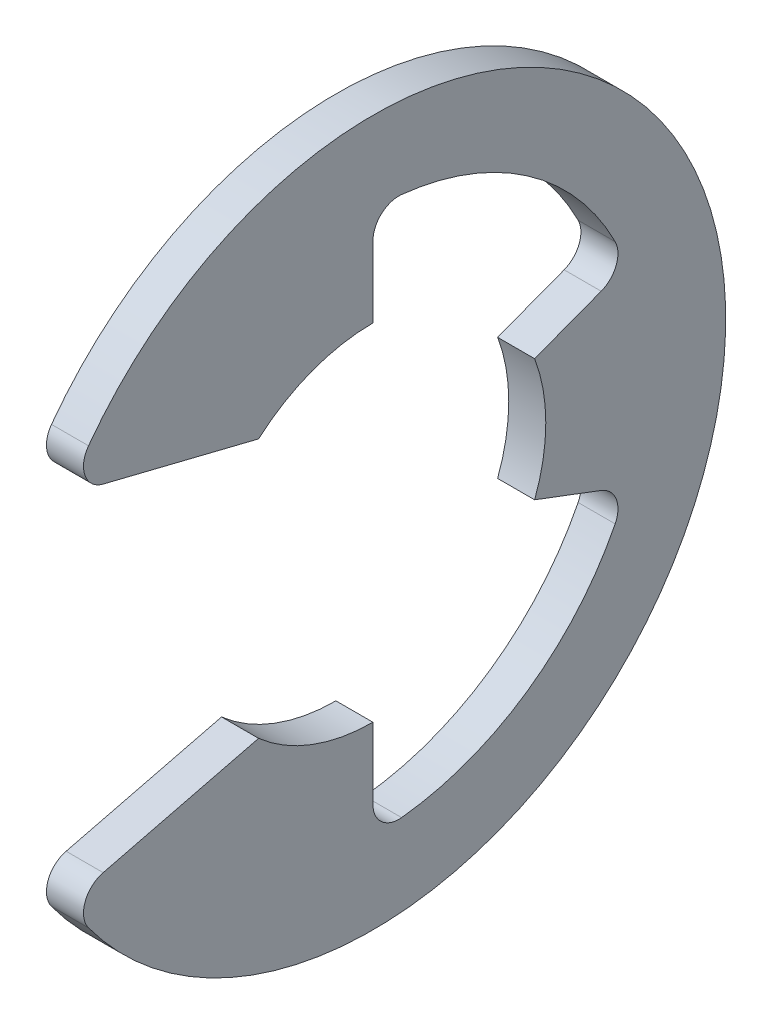
ISO-10303-21;
HEADER;
FILE_DESCRIPTION(('STEP AP214'),'2;1');
FILE_NAME('part.step','',(''),(''),'','','');
FILE_SCHEMA(('AUTOMOTIVE_DESIGN { 1 0 10303 214 1 1 1 1 }'));
ENDSEC;
DATA;
#1=APPLICATION_CONTEXT('core data for automotive mechanical design processes');
#2=APPLICATION_PROTOCOL_DEFINITION('international standard','automotive_design',2000,#1);
#3=PRODUCT_CONTEXT('',#1,'mechanical');
#4=PRODUCT('Part','Part','',(#3));
#5=PRODUCT_RELATED_PRODUCT_CATEGORY('part','',(#4));
#6=PRODUCT_DEFINITION_FORMATION('','',#4);
#7=PRODUCT_DEFINITION_CONTEXT('part definition',#1,'design');
#8=PRODUCT_DEFINITION('design','',#6,#7);
#9=PRODUCT_DEFINITION_SHAPE('','',#8);
#10=(LENGTH_UNIT() NAMED_UNIT(*) SI_UNIT(.MILLI.,.METRE.));
#11=(NAMED_UNIT(*) PLANE_ANGLE_UNIT() SI_UNIT($,.RADIAN.));
#12=(NAMED_UNIT(*) SI_UNIT($,.STERADIAN.) SOLID_ANGLE_UNIT());
#13=UNCERTAINTY_MEASURE_WITH_UNIT(LENGTH_MEASURE(1.E-05),#10,'distance_accuracy_value','');
#14=(GEOMETRIC_REPRESENTATION_CONTEXT(3) GLOBAL_UNCERTAINTY_ASSIGNED_CONTEXT((#13)) GLOBAL_UNIT_ASSIGNED_CONTEXT((#10,
#11,#12)) REPRESENTATION_CONTEXT('',''));
#15=CARTESIAN_POINT('',(0.,0.,0.));
#16=DIRECTION('',(0.,0.,1.));
#17=DIRECTION('',(1.,0.,0.));
#18=AXIS2_PLACEMENT_3D('',#15,#16,#17);
#19=CARTESIAN_POINT('',(0.5334,0.,0.));
#20=DIRECTION('',(1.,0.,0.));
#21=DIRECTION('',(0.,0.,-1.));
#22=AXIS2_PLACEMENT_3D('',#19,#20,#21);
#23=PLANE('',#22);
#24=DIRECTION('',(0.,-1.,0.));
#25=VECTOR('',#24,1.);
#26=CARTESIAN_POINT('',(0.5334,-4.9784,0.));
#27=LINE('',#26,#25);
#28=CARTESIAN_POINT('',(0.5334,-7.02704023617216,0.));
#29=VERTEX_POINT('',#28);
#30=CARTESIAN_POINT('',(0.5334,-4.9784,0.));
#31=VERTEX_POINT('',#30);
#32=EDGE_CURVE('E168',#29,#31,#27,.F.);
#33=ORIENTED_EDGE('',*,*,#32,.T.);
#34=CARTESIAN_POINT('',(0.5334,0.,0.));
#35=DIRECTION('',(-1.,0.,0.));
#36=DIRECTION('',(0.,0.,1.));
#37=AXIS2_PLACEMENT_3D('',#34,#35,#36);
#38=CIRCLE('',#37,4.9784);
#39=CARTESIAN_POINT('',(0.5334,-3.7338,3.29290208175099));
#40=VERTEX_POINT('',#39);
#41=EDGE_CURVE('E224',#31,#40,#38,.T.);
#42=ORIENTED_EDGE('',*,*,#41,.T.);
#43=DIRECTION('',(0.,0.240952820606873,-0.970536829925373));
#44=VECTOR('',#43,1.);
#45=CARTESIAN_POINT('',(0.5334,-5.09813480407811,8.78832302088672));
#46=LINE('',#45,#44);
#47=CARTESIAN_POINT('',(0.5334,-4.84496174240152,7.76856413164343));
#48=VERTEX_POINT('',#47);
#49=EDGE_CURVE('E163',#40,#48,#46,.F.);
#50=ORIENTED_EDGE('',*,*,#49,.T.);
#51=CARTESIAN_POINT('',(0.5334,-5.56971982551659,7.58863020332705));
#52=DIRECTION('',(-1.,0.,0.));
#53=DIRECTION('',(0.,0.,1.));
#54=AXIS2_PLACEMENT_3D('',#51,#52,#53);
#55=CIRCLE('',#54,0.746760000000001);
#56=CARTESIAN_POINT('',(0.5334,-6.01157023801035,8.19064242129201));
#57=VERTEX_POINT('',#56);
#58=EDGE_CURVE('E222',#57,#48,#55,.T.);
#59=ORIENTED_EDGE('',*,*,#58,.F.);
#60=CARTESIAN_POINT('',(0.5334,0.,0.));
#61=DIRECTION('',(-1.,0.,0.));
#62=DIRECTION('',(0.,0.,1.));
#63=AXIS2_PLACEMENT_3D('',#60,#61,#62);
#64=CIRCLE('',#63,10.16);
#65=CARTESIAN_POINT('',(0.5334,6.01157023801035,8.19064242129201));
#66=VERTEX_POINT('',#65);
#67=EDGE_CURVE('E143',#66,#57,#64,.T.);
#68=ORIENTED_EDGE('',*,*,#67,.F.);
#69=CARTESIAN_POINT('',(0.5334,5.56971982551659,7.58863020332705));
#70=DIRECTION('',(-1.,0.,0.));
#71=DIRECTION('',(0.,0.,1.));
#72=AXIS2_PLACEMENT_3D('',#69,#70,#71);
#73=CIRCLE('',#72,0.74676);
#74=CARTESIAN_POINT('',(0.5334,4.84496174240152,7.76856413164343));
#75=VERTEX_POINT('',#74);
#76=EDGE_CURVE('E21',#75,#66,#73,.T.);
#77=ORIENTED_EDGE('',*,*,#76,.F.);
#78=DIRECTION('',(0.,0.240952820606873,0.970536829925373));
#79=VECTOR('',#78,1.);
#80=CARTESIAN_POINT('',(0.5334,5.09813480407811,8.78832302088672));
#81=LINE('',#80,#79);
#82=CARTESIAN_POINT('',(0.5334,3.7338,3.29290208175099));
#83=VERTEX_POINT('',#82);
#84=EDGE_CURVE('E140',#75,#83,#81,.F.);
#85=ORIENTED_EDGE('',*,*,#84,.T.);
#86=CARTESIAN_POINT('',(0.5334,0.,0.));
#87=DIRECTION('',(-1.,0.,0.));
#88=DIRECTION('',(0.,0.,1.));
#89=AXIS2_PLACEMENT_3D('',#86,#87,#88);
#90=CIRCLE('',#89,4.9784);
#91=CARTESIAN_POINT('',(0.5334,4.9784,0.));
#92=VERTEX_POINT('',#91);
#93=EDGE_CURVE('E243',#83,#92,#90,.T.);
#94=ORIENTED_EDGE('',*,*,#93,.T.);
#95=DIRECTION('',(0.,-1.,0.));
#96=VECTOR('',#95,1.);
#97=CARTESIAN_POINT('',(0.5334,4.9784,0.));
#98=LINE('',#97,#96);
#99=CARTESIAN_POINT('',(0.5334,7.02704023617216,0.));
#100=VERTEX_POINT('',#99);
#101=EDGE_CURVE('E180',#92,#100,#98,.F.);
#102=ORIENTED_EDGE('',*,*,#101,.T.);
#103=CARTESIAN_POINT('',(0.5334,7.02704023617216,-0.746759999999999));
#104=DIRECTION('',(-1.,0.,0.));
#105=DIRECTION('',(0.,0.,1.));
#106=AXIS2_PLACEMENT_3D('',#103,#104,#105);
#107=CIRCLE('',#106,0.74676);
#108=CARTESIAN_POINT('',(0.5334,7.76961896112721,-0.825673464276603));
#109=VERTEX_POINT('',#108);
#110=EDGE_CURVE('E242',#100,#109,#107,.T.);
#111=ORIENTED_EDGE('',*,*,#110,.T.);
#112=CARTESIAN_POINT('',(0.5334,0.,0.));
#113=DIRECTION('',(-1.,0.,0.));
#114=DIRECTION('',(0.,0.,1.));
#115=AXIS2_PLACEMENT_3D('',#112,#113,#114);
#116=CIRCLE('',#115,7.81336774193548);
#117=CARTESIAN_POINT('',(0.5334,3.51932193149276,-6.97589339176224));
#118=VERTEX_POINT('',#117);
#119=EDGE_CURVE('E239',#109,#118,#116,.T.);
#120=ORIENTED_EDGE('',*,*,#119,.T.);
#121=CARTESIAN_POINT('',(0.5334,3.18296391887085,-6.30917472174839));
#122=DIRECTION('',(-1.,0.,0.));
#123=DIRECTION('',(0.,0.,1.));
#124=AXIS2_PLACEMENT_3D('',#121,#122,#123);
#125=CIRCLE('',#124,0.74676);
#126=CARTESIAN_POINT('',(0.5334,2.48443390133403,-6.57319425170782));
#127=VERTEX_POINT('',#126);
#128=EDGE_CURVE('E236',#118,#127,#125,.T.);
#129=ORIENTED_EDGE('',*,*,#128,.T.);
#130=DIRECTION('',(0.,0.353553390593274,-0.935414346693485));
#131=VECTOR('',#130,1.);
#132=CARTESIAN_POINT('',(0.5334,1.76013019972955,-4.65686678357885));
#133=LINE('',#132,#131);
#134=CARTESIAN_POINT('',(0.5334,1.76013019972955,-4.65686678357885));
#135=VERTEX_POINT('',#134);
#136=EDGE_CURVE('E176',#127,#135,#133,.F.);
#137=ORIENTED_EDGE('',*,*,#136,.T.);
#138=CARTESIAN_POINT('',(0.5334,0.,0.));
#139=DIRECTION('',(-1.,0.,0.));
#140=DIRECTION('',(0.,0.,1.));
#141=AXIS2_PLACEMENT_3D('',#138,#139,#140);
#142=CIRCLE('',#141,4.9784);
#143=CARTESIAN_POINT('',(0.5334,-1.76013019972955,-4.65686678357885));
#144=VERTEX_POINT('',#143);
#145=EDGE_CURVE('E234',#135,#144,#142,.T.);
#146=ORIENTED_EDGE('',*,*,#145,.T.);
#147=DIRECTION('',(0.,0.353553390593274,0.935414346693485));
#148=VECTOR('',#147,1.);
#149=CARTESIAN_POINT('',(0.5334,-1.76013019972955,-4.65686678357885));
#150=LINE('',#149,#148);
#151=CARTESIAN_POINT('',(0.5334,-2.48443390133403,-6.57319425170782));
#152=VERTEX_POINT('',#151);
#153=EDGE_CURVE('E172',#144,#152,#150,.F.);
#154=ORIENTED_EDGE('',*,*,#153,.T.);
#155=CARTESIAN_POINT('',(0.5334,-3.18296391887085,-6.30917472174839));
#156=DIRECTION('',(-1.,0.,0.));
#157=DIRECTION('',(0.,0.,1.));
#158=AXIS2_PLACEMENT_3D('',#155,#156,#157);
#159=CIRCLE('',#158,0.74676);
#160=CARTESIAN_POINT('',(0.5334,-3.51932193149276,-6.97589339176224));
#161=VERTEX_POINT('',#160);
#162=EDGE_CURVE('E232',#152,#161,#159,.T.);
#163=ORIENTED_EDGE('',*,*,#162,.T.);
#164=CARTESIAN_POINT('',(0.5334,0.,0.));
#165=DIRECTION('',(-1.,0.,0.));
#166=DIRECTION('',(0.,0.,1.));
#167=AXIS2_PLACEMENT_3D('',#164,#165,#166);
#168=CIRCLE('',#167,7.81336774193548);
#169=CARTESIAN_POINT('',(0.5334,-7.76961896112721,-0.825673464276605));
#170=VERTEX_POINT('',#169);
#171=EDGE_CURVE('E229',#161,#170,#168,.T.);
#172=ORIENTED_EDGE('',*,*,#171,.T.);
#173=CARTESIAN_POINT('',(0.5334,-7.02704023617216,-0.74676));
#174=DIRECTION('',(-1.,0.,0.));
#175=DIRECTION('',(0.,0.,1.));
#176=AXIS2_PLACEMENT_3D('',#173,#174,#175);
#177=CIRCLE('',#176,0.74676);
#178=EDGE_CURVE('E226',#170,#29,#177,.T.);
#179=ORIENTED_EDGE('',*,*,#178,.T.);
#180=EDGE_LOOP('',(#33,#42,#50,#59,#68,#77,#85,#94,#102,#111,#120,#129,#137,#146,#154,#163,#172,#179));
#181=FACE_BOUND('',#180,.T.);
#182=ADVANCED_FACE('F18',(#181),#23,.T.);
#183=CARTESIAN_POINT('',(0.5334,5.56971982551659,7.58863020332705));
#184=DIRECTION('',(-1.,0.,0.));
#185=DIRECTION('',(0.,0.,1.));
#186=AXIS2_PLACEMENT_3D('',#183,#184,#185);
#187=CYLINDRICAL_SURFACE('',#186,0.74676);
#188=CARTESIAN_POINT('',(-0.5334,5.56971982551659,7.58863020332705));
#189=DIRECTION('',(-1.,0.,0.));
#190=DIRECTION('',(0.,0.,1.));
#191=AXIS2_PLACEMENT_3D('',#188,#189,#190);
#192=CIRCLE('',#191,0.74676);
#193=CARTESIAN_POINT('',(-0.5334,6.01157023801035,8.19064242129201));
#194=VERTEX_POINT('',#193);
#195=CARTESIAN_POINT('',(-0.5334,4.84496174240152,7.76856413164343));
#196=VERTEX_POINT('',#195);
#197=EDGE_CURVE('E158',#194,#196,#192,.F.);
#198=ORIENTED_EDGE('',*,*,#197,.T.);
#199=DIRECTION('',(1.,0.,0.));
#200=VECTOR('',#199,1.);
#201=CARTESIAN_POINT('',(0.5334,4.84496174240152,7.76856413164343));
#202=LINE('',#201,#200);
#203=EDGE_CURVE('E148',#196,#75,#202,.T.);
#204=ORIENTED_EDGE('',*,*,#203,.T.);
#205=ORIENTED_EDGE('',*,*,#76,.T.);
#206=DIRECTION('',(-1.,0.,0.));
#207=VECTOR('',#206,1.);
#208=CARTESIAN_POINT('',(0.5334,6.01157023801035,8.19064242129201));
#209=LINE('',#208,#207);
#210=EDGE_CURVE('E219',#194,#66,#209,.F.);
#211=ORIENTED_EDGE('',*,*,#210,.F.);
#212=EDGE_LOOP('',(#198,#204,#205,#211));
#213=FACE_BOUND('',#212,.T.);
#214=ADVANCED_FACE('F157',(#213),#187,.T.);
#215=CARTESIAN_POINT('',(0.5334,5.09813480407811,8.78832302088672));
#216=DIRECTION('',(0.,0.970536829925373,-0.240952820606873));
#217=DIRECTION('',(0.,0.240952820606873,0.970536829925373));
#218=AXIS2_PLACEMENT_3D('',#215,#216,#217);
#219=PLANE('',#218);
#220=ORIENTED_EDGE('',*,*,#203,.F.);
#221=DIRECTION('',(0.,-0.240952820606873,-0.970536829925373));
#222=VECTOR('',#221,1.);
#223=CARTESIAN_POINT('',(-0.5334,4.84496174240152,7.76856413164343));
#224=LINE('',#223,#222);
#225=CARTESIAN_POINT('',(-0.5334,3.7338,3.29290208175099));
#226=VERTEX_POINT('',#225);
#227=EDGE_CURVE('E217',#196,#226,#224,.T.);
#228=ORIENTED_EDGE('',*,*,#227,.T.);
#229=DIRECTION('',(-1.,0.,0.));
#230=VECTOR('',#229,1.);
#231=CARTESIAN_POINT('',(0.5334,3.7338,3.29290208175099));
#232=LINE('',#231,#230);
#233=EDGE_CURVE('E155',#226,#83,#232,.F.);
#234=ORIENTED_EDGE('',*,*,#233,.T.);
#235=ORIENTED_EDGE('',*,*,#84,.F.);
#236=EDGE_LOOP('',(#220,#228,#234,#235));
#237=FACE_BOUND('',#236,.T.);
#238=ADVANCED_FACE('F152',(#237),#219,.F.);
#239=CARTESIAN_POINT('',(0.5334,0.,0.));
#240=DIRECTION('',(-1.,0.,0.));
#241=DIRECTION('',(0.,0.,1.));
#242=AXIS2_PLACEMENT_3D('',#239,#240,#241);
#243=CYLINDRICAL_SURFACE('',#242,4.9784);
#244=DIRECTION('',(1.,0.,0.));
#245=VECTOR('',#244,1.);
#246=CARTESIAN_POINT('',(0.5334,4.9784,0.));
#247=LINE('',#246,#245);
#248=CARTESIAN_POINT('',(-0.5334,4.9784,0.));
#249=VERTEX_POINT('',#248);
#250=EDGE_CURVE('E182',#249,#92,#247,.T.);
#251=ORIENTED_EDGE('',*,*,#250,.T.);
#252=ORIENTED_EDGE('',*,*,#93,.F.);
#253=ORIENTED_EDGE('',*,*,#233,.F.);
#254=CARTESIAN_POINT('',(-0.5334,0.,0.));
#255=DIRECTION('',(-1.,0.,0.));
#256=DIRECTION('',(0.,0.,1.));
#257=AXIS2_PLACEMENT_3D('',#254,#255,#256);
#258=CIRCLE('',#257,4.9784);
#259=EDGE_CURVE('E214',#226,#249,#258,.T.);
#260=ORIENTED_EDGE('',*,*,#259,.T.);
#261=EDGE_LOOP('',(#251,#252,#253,#260));
#262=FACE_BOUND('',#261,.T.);
#263=ADVANCED_FACE('F341',(#262),#243,.F.);
#264=CARTESIAN_POINT('',(0.5334,4.9784,0.));
#265=DIRECTION('',(0.,0.,1.));
#266=DIRECTION('',(0.,-1.,0.));
#267=AXIS2_PLACEMENT_3D('',#264,#265,#266);
#268=PLANE('',#267);
#269=DIRECTION('',(-1.,0.,0.));
#270=VECTOR('',#269,1.);
#271=CARTESIAN_POINT('',(0.5334,7.02704023617216,0.));
#272=LINE('',#271,#270);
#273=CARTESIAN_POINT('',(-0.5334,7.02704023617216,0.));
#274=VERTEX_POINT('',#273);
#275=EDGE_CURVE('E181',#274,#100,#272,.F.);
#276=ORIENTED_EDGE('',*,*,#275,.T.);
#277=ORIENTED_EDGE('',*,*,#101,.F.);
#278=ORIENTED_EDGE('',*,*,#250,.F.);
#279=DIRECTION('',(0.,1.,0.));
#280=VECTOR('',#279,1.);
#281=CARTESIAN_POINT('',(-0.5334,0.,0.));
#282=LINE('',#281,#280);
#283=EDGE_CURVE('E213',#249,#274,#282,.T.);
#284=ORIENTED_EDGE('',*,*,#283,.T.);
#285=EDGE_LOOP('',(#276,#277,#278,#284));
#286=FACE_BOUND('',#285,.T.);
#287=ADVANCED_FACE('F339',(#286),#268,.F.);
#288=CARTESIAN_POINT('',(0.5334,7.02704023617216,-0.746759999999999));
#289=DIRECTION('',(-1.,0.,0.));
#290=DIRECTION('',(0.,0.,1.));
#291=AXIS2_PLACEMENT_3D('',#288,#289,#290);
#292=CYLINDRICAL_SURFACE('',#291,0.74676);
#293=ORIENTED_EDGE('',*,*,#275,.F.);
#294=CARTESIAN_POINT('',(-0.5334,7.02704023617216,-0.746759999999999));
#295=DIRECTION('',(-1.,0.,0.));
#296=DIRECTION('',(0.,0.,1.));
#297=AXIS2_PLACEMENT_3D('',#294,#295,#296);
#298=CIRCLE('',#297,0.74676);
#299=CARTESIAN_POINT('',(-0.5334,7.76961896112721,-0.825673464276603));
#300=VERTEX_POINT('',#299);
#301=EDGE_CURVE('E210',#274,#300,#298,.T.);
#302=ORIENTED_EDGE('',*,*,#301,.T.);
#303=DIRECTION('',(-1.,0.,0.));
#304=VECTOR('',#303,1.);
#305=CARTESIAN_POINT('',(0.5334,7.76961896112721,-0.825673464276603));
#306=LINE('',#305,#304);
#307=EDGE_CURVE('E241',#300,#109,#306,.F.);
#308=ORIENTED_EDGE('',*,*,#307,.T.);
#309=ORIENTED_EDGE('',*,*,#110,.F.);
#310=EDGE_LOOP('',(#293,#302,#308,#309));
#311=FACE_BOUND('',#310,.T.);
#312=ADVANCED_FACE('F336',(#311),#292,.F.);
#313=CARTESIAN_POINT('',(0.5334,0.,0.));
#314=DIRECTION('',(-1.,0.,0.));
#315=DIRECTION('',(0.,0.,1.));
#316=AXIS2_PLACEMENT_3D('',#313,#314,#315);
#317=CYLINDRICAL_SURFACE('',#316,7.81336774193548);
#318=ORIENTED_EDGE('',*,*,#307,.F.);
#319=CARTESIAN_POINT('',(-0.5334,0.,0.));
#320=DIRECTION('',(-1.,0.,0.));
#321=DIRECTION('',(0.,0.,1.));
#322=AXIS2_PLACEMENT_3D('',#319,#320,#321);
#323=CIRCLE('',#322,7.81336774193548);
#324=CARTESIAN_POINT('',(-0.5334,3.51932193149276,-6.97589339176224));
#325=VERTEX_POINT('',#324);
#326=EDGE_CURVE('E207',#300,#325,#323,.T.);
#327=ORIENTED_EDGE('',*,*,#326,.T.);
#328=DIRECTION('',(-1.,0.,0.));
#329=VECTOR('',#328,1.);
#330=CARTESIAN_POINT('',(0.5334,3.51932193149276,-6.97589339176224));
#331=LINE('',#330,#329);
#332=EDGE_CURVE('E238',#325,#118,#331,.F.);
#333=ORIENTED_EDGE('',*,*,#332,.T.);
#334=ORIENTED_EDGE('',*,*,#119,.F.);
#335=EDGE_LOOP('',(#318,#327,#333,#334));
#336=FACE_BOUND('',#335,.T.);
#337=ADVANCED_FACE('F332',(#336),#317,.F.);
#338=CARTESIAN_POINT('',(0.5334,3.18296391887085,-6.30917472174839));
#339=DIRECTION('',(-1.,0.,0.));
#340=DIRECTION('',(0.,0.,1.));
#341=AXIS2_PLACEMENT_3D('',#338,#339,#340);
#342=CYLINDRICAL_SURFACE('',#341,0.74676);
#343=ORIENTED_EDGE('',*,*,#332,.F.);
#344=CARTESIAN_POINT('',(-0.5334,3.18296391887085,-6.30917472174839));
#345=DIRECTION('',(-1.,0.,0.));
#346=DIRECTION('',(0.,0.,1.));
#347=AXIS2_PLACEMENT_3D('',#344,#345,#346);
#348=CIRCLE('',#347,0.74676);
#349=CARTESIAN_POINT('',(-0.5334,2.48443390133403,-6.57319425170782));
#350=VERTEX_POINT('',#349);
#351=EDGE_CURVE('E204',#325,#350,#348,.T.);
#352=ORIENTED_EDGE('',*,*,#351,.T.);
#353=DIRECTION('',(1.,0.,0.));
#354=VECTOR('',#353,1.);
#355=CARTESIAN_POINT('',(0.5334,2.48443390133403,-6.57319425170782));
#356=LINE('',#355,#354);
#357=EDGE_CURVE('E179',#350,#127,#356,.T.);
#358=ORIENTED_EDGE('',*,*,#357,.T.);
#359=ORIENTED_EDGE('',*,*,#128,.F.);
#360=EDGE_LOOP('',(#343,#352,#358,#359));
#361=FACE_BOUND('',#360,.T.);
#362=ADVANCED_FACE('F328',(#361),#342,.F.);
#363=CARTESIAN_POINT('',(0.5334,1.76013019972955,-4.65686678357885));
#364=DIRECTION('',(0.,-0.935414346693485,-0.353553390593274));
#365=DIRECTION('',(0.,0.353553390593274,-0.935414346693485));
#366=AXIS2_PLACEMENT_3D('',#363,#364,#365);
#367=PLANE('',#366);
#368=ORIENTED_EDGE('',*,*,#357,.F.);
#369=DIRECTION('',(0.,-0.353553390593275,0.935414346693485));
#370=VECTOR('',#369,1.);
#371=CARTESIAN_POINT('',(-0.5334,2.48443390133403,-6.57319425170782));
#372=LINE('',#371,#370);
#373=CARTESIAN_POINT('',(-0.5334,1.76013019972955,-4.65686678357885));
#374=VERTEX_POINT('',#373);
#375=EDGE_CURVE('E203',#350,#374,#372,.T.);
#376=ORIENTED_EDGE('',*,*,#375,.T.);
#377=DIRECTION('',(-1.,0.,0.));
#378=VECTOR('',#377,1.);
#379=CARTESIAN_POINT('',(0.5334,1.76013019972955,-4.65686678357885));
#380=LINE('',#379,#378);
#381=EDGE_CURVE('E178',#374,#135,#380,.F.);
#382=ORIENTED_EDGE('',*,*,#381,.T.);
#383=ORIENTED_EDGE('',*,*,#136,.F.);
#384=EDGE_LOOP('',(#368,#376,#382,#383));
#385=FACE_BOUND('',#384,.T.);
#386=ADVANCED_FACE('F324',(#385),#367,.F.);
#387=CARTESIAN_POINT('',(0.5334,0.,0.));
#388=DIRECTION('',(-1.,0.,0.));
#389=DIRECTION('',(0.,0.,1.));
#390=AXIS2_PLACEMENT_3D('',#387,#388,#389);
#391=CYLINDRICAL_SURFACE('',#390,4.9784);
#392=DIRECTION('',(1.,0.,0.));
#393=VECTOR('',#392,1.);
#394=CARTESIAN_POINT('',(0.5334,-1.76013019972955,-4.65686678357885));
#395=LINE('',#394,#393);
#396=CARTESIAN_POINT('',(-0.5334,-1.76013019972955,-4.65686678357885));
#397=VERTEX_POINT('',#396);
#398=EDGE_CURVE('E175',#397,#144,#395,.T.);
#399=ORIENTED_EDGE('',*,*,#398,.T.);
#400=ORIENTED_EDGE('',*,*,#145,.F.);
#401=ORIENTED_EDGE('',*,*,#381,.F.);
#402=CARTESIAN_POINT('',(-0.5334,0.,0.));
#403=DIRECTION('',(-1.,0.,0.));
#404=DIRECTION('',(0.,0.,1.));
#405=AXIS2_PLACEMENT_3D('',#402,#403,#404);
#406=CIRCLE('',#405,4.9784);
#407=EDGE_CURVE('E200',#374,#397,#406,.T.);
#408=ORIENTED_EDGE('',*,*,#407,.T.);
#409=EDGE_LOOP('',(#399,#400,#401,#408));
#410=FACE_BOUND('',#409,.T.);
#411=ADVANCED_FACE('F320',(#410),#391,.F.);
#412=CARTESIAN_POINT('',(0.5334,-1.76013019972955,-4.65686678357885));
#413=DIRECTION('',(0.,0.935414346693485,-0.353553390593274));
#414=DIRECTION('',(0.,0.353553390593274,0.935414346693485));
#415=AXIS2_PLACEMENT_3D('',#412,#413,#414);
#416=PLANE('',#415);
#417=DIRECTION('',(-1.,0.,0.));
#418=VECTOR('',#417,1.);
#419=CARTESIAN_POINT('',(0.5334,-2.48443390133403,-6.57319425170782));
#420=LINE('',#419,#418);
#421=CARTESIAN_POINT('',(-0.5334,-2.48443390133403,-6.57319425170782));
#422=VERTEX_POINT('',#421);
#423=EDGE_CURVE('E174',#422,#152,#420,.F.);
#424=ORIENTED_EDGE('',*,*,#423,.T.);
#425=ORIENTED_EDGE('',*,*,#153,.F.);
#426=ORIENTED_EDGE('',*,*,#398,.F.);
#427=DIRECTION('',(0.,-0.353553390593274,-0.935414346693485));
#428=VECTOR('',#427,1.);
#429=CARTESIAN_POINT('',(-0.5334,-1.76013019972955,-4.65686678357885));
#430=LINE('',#429,#428);
#431=EDGE_CURVE('E199',#397,#422,#430,.T.);
#432=ORIENTED_EDGE('',*,*,#431,.T.);
#433=EDGE_LOOP('',(#424,#425,#426,#432));
#434=FACE_BOUND('',#433,.T.);
#435=ADVANCED_FACE('F316',(#434),#416,.F.);
#436=CARTESIAN_POINT('',(0.5334,-3.18296391887085,-6.30917472174839));
#437=DIRECTION('',(-1.,0.,0.));
#438=DIRECTION('',(0.,0.,1.));
#439=AXIS2_PLACEMENT_3D('',#436,#437,#438);
#440=CYLINDRICAL_SURFACE('',#439,0.74676);
#441=ORIENTED_EDGE('',*,*,#423,.F.);
#442=CARTESIAN_POINT('',(-0.5334,-3.18296391887085,-6.30917472174839));
#443=DIRECTION('',(-1.,0.,0.));
#444=DIRECTION('',(0.,0.,1.));
#445=AXIS2_PLACEMENT_3D('',#442,#443,#444);
#446=CIRCLE('',#445,0.74676);
#447=CARTESIAN_POINT('',(-0.5334,-3.51932193149276,-6.97589339176224));
#448=VERTEX_POINT('',#447);
#449=EDGE_CURVE('E196',#422,#448,#446,.T.);
#450=ORIENTED_EDGE('',*,*,#449,.T.);
#451=DIRECTION('',(-1.,0.,0.));
#452=VECTOR('',#451,1.);
#453=CARTESIAN_POINT('',(0.5334,-3.51932193149276,-6.97589339176224));
#454=LINE('',#453,#452);
#455=EDGE_CURVE('E231',#448,#161,#454,.F.);
#456=ORIENTED_EDGE('',*,*,#455,.T.);
#457=ORIENTED_EDGE('',*,*,#162,.F.);
#458=EDGE_LOOP('',(#441,#450,#456,#457));
#459=FACE_BOUND('',#458,.T.);
#460=ADVANCED_FACE('F312',(#459),#440,.F.);
#461=CARTESIAN_POINT('',(0.5334,0.,0.));
#462=DIRECTION('',(-1.,0.,0.));
#463=DIRECTION('',(0.,0.,1.));
#464=AXIS2_PLACEMENT_3D('',#461,#462,#463);
#465=CYLINDRICAL_SURFACE('',#464,7.81336774193548);
#466=DIRECTION('',(-1.,0.,0.));
#467=VECTOR('',#466,1.);
#468=CARTESIAN_POINT('',(0.5334,-7.76961896112721,-0.825673464276605));
#469=LINE('',#468,#467);
#470=CARTESIAN_POINT('',(-0.5334,-7.76961896112721,-0.825673464276605));
#471=VERTEX_POINT('',#470);
#472=EDGE_CURVE('E228',#471,#170,#469,.F.);
#473=ORIENTED_EDGE('',*,*,#472,.T.);
#474=ORIENTED_EDGE('',*,*,#171,.F.);
#475=ORIENTED_EDGE('',*,*,#455,.F.);
#476=CARTESIAN_POINT('',(-0.5334,0.,0.));
#477=DIRECTION('',(-1.,0.,0.));
#478=DIRECTION('',(0.,0.,1.));
#479=AXIS2_PLACEMENT_3D('',#476,#477,#478);
#480=CIRCLE('',#479,7.81336774193548);
#481=EDGE_CURVE('E193',#448,#471,#480,.T.);
#482=ORIENTED_EDGE('',*,*,#481,.T.);
#483=EDGE_LOOP('',(#473,#474,#475,#482));
#484=FACE_BOUND('',#483,.T.);
#485=ADVANCED_FACE('F308',(#484),#465,.F.);
#486=CARTESIAN_POINT('',(0.5334,-7.02704023617216,-0.74676));
#487=DIRECTION('',(-1.,0.,0.));
#488=DIRECTION('',(0.,0.,1.));
#489=AXIS2_PLACEMENT_3D('',#486,#487,#488);
#490=CYLINDRICAL_SURFACE('',#489,0.74676);
#491=ORIENTED_EDGE('',*,*,#472,.F.);
#492=CARTESIAN_POINT('',(-0.5334,-7.02704023617216,-0.74676));
#493=DIRECTION('',(-1.,0.,0.));
#494=DIRECTION('',(0.,0.,1.));
#495=AXIS2_PLACEMENT_3D('',#492,#493,#494);
#496=CIRCLE('',#495,0.74676);
#497=CARTESIAN_POINT('',(-0.5334,-7.02704023617216,0.));
#498=VERTEX_POINT('',#497);
#499=EDGE_CURVE('E190',#471,#498,#496,.T.);
#500=ORIENTED_EDGE('',*,*,#499,.T.);
#501=DIRECTION('',(1.,0.,0.));
#502=VECTOR('',#501,1.);
#503=CARTESIAN_POINT('',(0.5334,-7.02704023617216,0.));
#504=LINE('',#503,#502);
#505=EDGE_CURVE('E171',#498,#29,#504,.T.);
#506=ORIENTED_EDGE('',*,*,#505,.T.);
#507=ORIENTED_EDGE('',*,*,#178,.F.);
#508=EDGE_LOOP('',(#491,#500,#506,#507));
#509=FACE_BOUND('',#508,.T.);
#510=ADVANCED_FACE('F304',(#509),#490,.F.);
#511=CARTESIAN_POINT('',(0.5334,-4.9784,0.));
#512=DIRECTION('',(0.,0.,1.));
#513=DIRECTION('',(0.,-1.,0.));
#514=AXIS2_PLACEMENT_3D('',#511,#512,#513);
#515=PLANE('',#514);
#516=ORIENTED_EDGE('',*,*,#505,.F.);
#517=DIRECTION('',(0.,1.,0.));
#518=VECTOR('',#517,1.);
#519=CARTESIAN_POINT('',(-0.5334,0.,0.));
#520=LINE('',#519,#518);
#521=CARTESIAN_POINT('',(-0.5334,-4.9784,0.));
#522=VERTEX_POINT('',#521);
#523=EDGE_CURVE('E189',#498,#522,#520,.T.);
#524=ORIENTED_EDGE('',*,*,#523,.T.);
#525=DIRECTION('',(-1.,0.,0.));
#526=VECTOR('',#525,1.);
#527=CARTESIAN_POINT('',(0.5334,-4.9784,0.));
#528=LINE('',#527,#526);
#529=EDGE_CURVE('E170',#522,#31,#528,.F.);
#530=ORIENTED_EDGE('',*,*,#529,.T.);
#531=ORIENTED_EDGE('',*,*,#32,.F.);
#532=EDGE_LOOP('',(#516,#524,#530,#531));
#533=FACE_BOUND('',#532,.T.);
#534=ADVANCED_FACE('F300',(#533),#515,.F.);
#535=CARTESIAN_POINT('',(0.5334,0.,0.));
#536=DIRECTION('',(-1.,0.,0.));
#537=DIRECTION('',(0.,0.,1.));
#538=AXIS2_PLACEMENT_3D('',#535,#536,#537);
#539=CYLINDRICAL_SURFACE('',#538,4.9784);
#540=DIRECTION('',(1.,0.,0.));
#541=VECTOR('',#540,1.);
#542=CARTESIAN_POINT('',(0.5334,-3.7338,3.29290208175099));
#543=LINE('',#542,#541);
#544=CARTESIAN_POINT('',(-0.5334,-3.7338,3.29290208175099));
#545=VERTEX_POINT('',#544);
#546=EDGE_CURVE('E167',#545,#40,#543,.T.);
#547=ORIENTED_EDGE('',*,*,#546,.T.);
#548=ORIENTED_EDGE('',*,*,#41,.F.);
#549=ORIENTED_EDGE('',*,*,#529,.F.);
#550=CARTESIAN_POINT('',(-0.5334,0.,0.));
#551=DIRECTION('',(-1.,0.,0.));
#552=DIRECTION('',(0.,0.,1.));
#553=AXIS2_PLACEMENT_3D('',#550,#551,#552);
#554=CIRCLE('',#553,4.9784);
#555=EDGE_CURVE('E186',#522,#545,#554,.T.);
#556=ORIENTED_EDGE('',*,*,#555,.T.);
#557=EDGE_LOOP('',(#547,#548,#549,#556));
#558=FACE_BOUND('',#557,.T.);
#559=ADVANCED_FACE('F296',(#558),#539,.F.);
#560=CARTESIAN_POINT('',(0.5334,-5.09813480407811,8.78832302088672));
#561=DIRECTION('',(0.,-0.970536829925373,-0.240952820606873));
#562=DIRECTION('',(0.,0.240952820606873,-0.970536829925373));
#563=AXIS2_PLACEMENT_3D('',#560,#561,#562);
#564=PLANE('',#563);
#565=DIRECTION('',(-1.,0.,0.));
#566=VECTOR('',#565,1.);
#567=CARTESIAN_POINT('',(0.5334,-4.84496174240152,7.76856413164343));
#568=LINE('',#567,#566);
#569=CARTESIAN_POINT('',(-0.5334,-4.84496174240152,7.76856413164343));
#570=VERTEX_POINT('',#569);
#571=EDGE_CURVE('E166',#48,#570,#568,.T.);
#572=ORIENTED_EDGE('',*,*,#571,.F.);
#573=ORIENTED_EDGE('',*,*,#49,.F.);
#574=ORIENTED_EDGE('',*,*,#546,.F.);
#575=DIRECTION('',(0.,-0.240952820606873,0.970536829925373));
#576=VECTOR('',#575,1.);
#577=CARTESIAN_POINT('',(-0.5334,-3.7338,3.29290208175099));
#578=LINE('',#577,#576);
#579=EDGE_CURVE('E185',#545,#570,#578,.T.);
#580=ORIENTED_EDGE('',*,*,#579,.T.);
#581=EDGE_LOOP('',(#572,#573,#574,#580));
#582=FACE_BOUND('',#581,.T.);
#583=ADVANCED_FACE('F288',(#582),#564,.F.);
#584=CARTESIAN_POINT('',(0.5334,-5.56971982551659,7.58863020332705));
#585=DIRECTION('',(-1.,0.,0.));
#586=DIRECTION('',(0.,0.,1.));
#587=AXIS2_PLACEMENT_3D('',#584,#585,#586);
#588=CYLINDRICAL_SURFACE('',#587,0.746760000000001);
#589=CARTESIAN_POINT('',(-0.5334,-5.56971982551659,7.58863020332705));
#590=DIRECTION('',(-1.,0.,0.));
#591=DIRECTION('',(0.,0.,1.));
#592=AXIS2_PLACEMENT_3D('',#589,#590,#591);
#593=CIRCLE('',#592,0.746760000000001);
#594=CARTESIAN_POINT('',(-0.5334,-6.01157023801035,8.19064242129201));
#595=VERTEX_POINT('',#594);
#596=EDGE_CURVE('E27',#570,#595,#593,.F.);
#597=ORIENTED_EDGE('',*,*,#596,.T.);
#598=DIRECTION('',(-1.,0.,0.));
#599=VECTOR('',#598,1.);
#600=CARTESIAN_POINT('',(0.5334,-6.01157023801035,8.19064242129201));
#601=LINE('',#600,#599);
#602=EDGE_CURVE('E221',#57,#595,#601,.T.);
#603=ORIENTED_EDGE('',*,*,#602,.F.);
#604=ORIENTED_EDGE('',*,*,#58,.T.);
#605=ORIENTED_EDGE('',*,*,#571,.T.);
#606=EDGE_LOOP('',(#597,#603,#604,#605));
#607=FACE_BOUND('',#606,.T.);
#608=ADVANCED_FACE('F357',(#607),#588,.T.);
#609=CARTESIAN_POINT('',(0.5334,0.,0.));
#610=DIRECTION('',(-1.,0.,0.));
#611=DIRECTION('',(0.,0.,1.));
#612=AXIS2_PLACEMENT_3D('',#609,#610,#611);
#613=CYLINDRICAL_SURFACE('',#612,10.16);
#614=CARTESIAN_POINT('',(-0.5334,0.,0.));
#615=DIRECTION('',(-1.,0.,0.));
#616=DIRECTION('',(0.,0.,1.));
#617=AXIS2_PLACEMENT_3D('',#614,#615,#616);
#618=CIRCLE('',#617,10.16);
#619=EDGE_CURVE('E11',#595,#194,#618,.F.);
#620=ORIENTED_EDGE('',*,*,#619,.T.);
#621=ORIENTED_EDGE('',*,*,#210,.T.);
#622=ORIENTED_EDGE('',*,*,#67,.T.);
#623=ORIENTED_EDGE('',*,*,#602,.T.);
#624=EDGE_LOOP('',(#620,#621,#622,#623));
#625=FACE_BOUND('',#624,.T.);
#626=ADVANCED_FACE('F352',(#625),#613,.T.);
#627=CARTESIAN_POINT('',(-0.5334,0.,0.));
#628=DIRECTION('',(1.,0.,0.));
#629=DIRECTION('',(0.,0.,-1.));
#630=AXIS2_PLACEMENT_3D('',#627,#628,#629);
#631=PLANE('',#630);
#632=ORIENTED_EDGE('',*,*,#619,.F.);
#633=ORIENTED_EDGE('',*,*,#596,.F.);
#634=ORIENTED_EDGE('',*,*,#579,.F.);
#635=ORIENTED_EDGE('',*,*,#555,.F.);
#636=ORIENTED_EDGE('',*,*,#523,.F.);
#637=ORIENTED_EDGE('',*,*,#499,.F.);
#638=ORIENTED_EDGE('',*,*,#481,.F.);
#639=ORIENTED_EDGE('',*,*,#449,.F.);
#640=ORIENTED_EDGE('',*,*,#431,.F.);
#641=ORIENTED_EDGE('',*,*,#407,.F.);
#642=ORIENTED_EDGE('',*,*,#375,.F.);
#643=ORIENTED_EDGE('',*,*,#351,.F.);
#644=ORIENTED_EDGE('',*,*,#326,.F.);
#645=ORIENTED_EDGE('',*,*,#301,.F.);
#646=ORIENTED_EDGE('',*,*,#283,.F.);
#647=ORIENTED_EDGE('',*,*,#259,.F.);
#648=ORIENTED_EDGE('',*,*,#227,.F.);
#649=ORIENTED_EDGE('',*,*,#197,.F.);
#650=EDGE_LOOP('',(#632,#633,#634,#635,#636,#637,#638,#639,#640,#641,#642,#643,#644,#645,#646,
#647,#648,#649));
#651=FACE_BOUND('',#650,.T.);
#652=ADVANCED_FACE('F293',(#651),#631,.F.);
#653=CLOSED_SHELL('',(#182,#214,#238,#263,#287,#312,#337,#362,#386,#411,#435,#460,#485,#510,
#534,#559,#583,#608,#626,#652));
#654=MANIFOLD_SOLID_BREP('B1',#653);
#655=ADVANCED_BREP_SHAPE_REPRESENTATION('',(#18,#654),#14);
#656=SHAPE_DEFINITION_REPRESENTATION(#9,#655);
ENDSEC;
END-ISO-10303-21;
